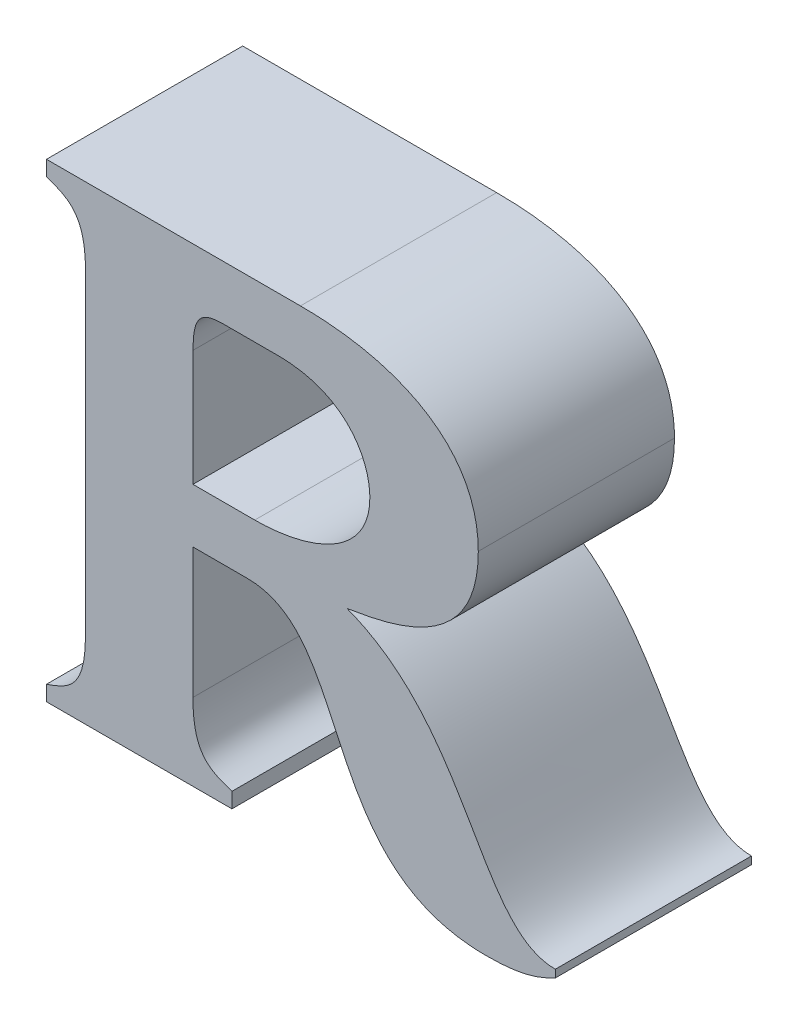
ISO-10303-21;
HEADER;
FILE_DESCRIPTION(('STEP AP214'),'2;1');
FILE_NAME('part.step','',(''),(''),'','','');
FILE_SCHEMA(('AUTOMOTIVE_DESIGN { 1 0 10303 214 1 1 1 1 }'));
ENDSEC;
DATA;
#1=APPLICATION_CONTEXT('core data for automotive mechanical design processes');
#2=APPLICATION_PROTOCOL_DEFINITION('international standard','automotive_design',2000,#1);
#3=PRODUCT_CONTEXT('',#1,'mechanical');
#4=PRODUCT('Part','Part','',(#3));
#5=PRODUCT_RELATED_PRODUCT_CATEGORY('part','',(#4));
#6=PRODUCT_DEFINITION_FORMATION('','',#4);
#7=PRODUCT_DEFINITION_CONTEXT('part definition',#1,'design');
#8=PRODUCT_DEFINITION('design','',#6,#7);
#9=PRODUCT_DEFINITION_SHAPE('','',#8);
#10=(LENGTH_UNIT() NAMED_UNIT(*) SI_UNIT(.MILLI.,.METRE.));
#11=(NAMED_UNIT(*) PLANE_ANGLE_UNIT() SI_UNIT($,.RADIAN.));
#12=(NAMED_UNIT(*) SI_UNIT($,.STERADIAN.) SOLID_ANGLE_UNIT());
#13=UNCERTAINTY_MEASURE_WITH_UNIT(LENGTH_MEASURE(1.E-05),#10,'distance_accuracy_value','');
#14=(GEOMETRIC_REPRESENTATION_CONTEXT(3) GLOBAL_UNCERTAINTY_ASSIGNED_CONTEXT((#13)) GLOBAL_UNIT_ASSIGNED_CONTEXT((#10,
#11,#12)) REPRESENTATION_CONTEXT('',''));
#15=CARTESIAN_POINT('',(0.,0.,0.));
#16=DIRECTION('',(0.,0.,1.));
#17=DIRECTION('',(1.,0.,0.));
#18=AXIS2_PLACEMENT_3D('',#15,#16,#17);
#19=CARTESIAN_POINT('',(3.0695177188296,-0.23959597746735,0.));
#20=DIRECTION('',(-1.,0.,0.));
#21=DIRECTION('',(0.,-1.,0.));
#22=AXIS2_PLACEMENT_3D('',#19,#20,#21);
#23=PLANE('',#22);
#24=DIRECTION('',(0.,-1.,0.));
#25=VECTOR('',#24,1.);
#26=CARTESIAN_POINT('',(3.0695177188296,-0.281685607356659,0.));
#27=LINE('',#26,#25);
#28=CARTESIAN_POINT('',(3.0695177188296,-0.23959597746735,0.));
#29=VERTEX_POINT('',#28);
#30=CARTESIAN_POINT('',(3.0695177188296,-0.298738196220763,0.));
#31=VERTEX_POINT('',#30);
#32=EDGE_CURVE('E11',#29,#31,#27,.T.);
#33=ORIENTED_EDGE('',*,*,#32,.F.);
#34=DIRECTION('',(0.,0.,1.));
#35=VECTOR('',#34,1.);
#36=CARTESIAN_POINT('',(3.0695177188296,-0.23959597746735,0.));
#37=LINE('',#36,#35);
#38=CARTESIAN_POINT('',(3.0695177188296,-0.23959597746735,0.1));
#39=VERTEX_POINT('',#38);
#40=EDGE_CURVE('E24',#29,#39,#37,.T.);
#41=ORIENTED_EDGE('',*,*,#40,.T.);
#42=DIRECTION('',(0.,1.,0.));
#43=VECTOR('',#42,1.);
#44=CARTESIAN_POINT('',(3.0695177188296,-0.281685607356659,0.1));
#45=LINE('',#44,#43);
#46=CARTESIAN_POINT('',(3.0695177188296,-0.298738196220763,0.1));
#47=VERTEX_POINT('',#46);
#48=EDGE_CURVE('E464',#47,#39,#45,.T.);
#49=ORIENTED_EDGE('',*,*,#48,.F.);
#50=DIRECTION('',(0.,0.,1.));
#51=VECTOR('',#50,1.);
#52=CARTESIAN_POINT('',(3.0695177188296,-0.298738196220763,0.));
#53=LINE('',#52,#51);
#54=EDGE_CURVE('E458',#31,#47,#53,.T.);
#55=ORIENTED_EDGE('',*,*,#54,.F.);
#56=EDGE_LOOP('',(#33,#41,#49,#55));
#57=FACE_BOUND('',#56,.T.);
#58=ADVANCED_FACE('F17',(#57),#23,.F.);
#59=CARTESIAN_POINT('',(3.0855156864987,-0.220205080166189,0.));
#60=CARTESIAN_POINT('',(3.0855156864987,-0.220205080166189,0.1));
#61=CARTESIAN_POINT('',(3.0733952497531,-0.220205080091428,0.));
#62=CARTESIAN_POINT('',(3.0733952497531,-0.220205080091428,0.1));
#63=CARTESIAN_POINT('',(3.0695177188059,-0.224083187468112,0.));
#64=CARTESIAN_POINT('',(3.0695177188059,-0.224083187468112,0.1));
#65=CARTESIAN_POINT('',(3.0695177188296,-0.23959597746735,0.));
#66=CARTESIAN_POINT('',(3.0695177188296,-0.23959597746735,0.1));
#67=B_SPLINE_SURFACE_WITH_KNOTS('',3,1,((#59,#60),(#61,#62),(#63,#64),(#65,#66)),.UNSPECIFIED.,
.F.,.F.,.F.,(4,4),(2,2),(-1.,0.),(0.,0.01),.UNSPECIFIED.);
#68=CARTESIAN_POINT('',(3.0855156864987,-0.220205080166189,0.));
#69=CARTESIAN_POINT('',(3.0733952497531,-0.220205080091428,0.));
#70=CARTESIAN_POINT('',(3.0695177188059,-0.224083187468112,0.));
#71=CARTESIAN_POINT('',(3.0695177188296,-0.23959597746735,0.));
#72=B_SPLINE_CURVE_WITH_KNOTS('',3,(#68,#69,#70,#71),.UNSPECIFIED.,.F.,.F.,(4,4),(-1.,0.),.UNSPECIFIED.);
#73=CARTESIAN_POINT('',(3.0855156864987,-0.220205080166189,0.));
#74=VERTEX_POINT('',#73);
#75=EDGE_CURVE('E454',#74,#29,#72,.T.);
#76=DIRECTION('',(0.,0.,1.));
#77=VECTOR('',#76,1.);
#78=CARTESIAN_POINT('',(3.0855156864987,-0.220205080166189,0.));
#79=LINE('',#78,#77);
#80=CARTESIAN_POINT('',(3.0855156864987,-0.220205080166189,0.1));
#81=VERTEX_POINT('',#80);
#82=EDGE_CURVE('E448',#74,#81,#79,.T.);
#83=CARTESIAN_POINT('',(3.0695177188296,-0.23959597746735,0.1));
#84=CARTESIAN_POINT('',(3.0695177188059,-0.224083187468112,0.1));
#85=CARTESIAN_POINT('',(3.0733952497531,-0.220205080091428,0.1));
#86=CARTESIAN_POINT('',(3.0855156864987,-0.220205080166189,0.1));
#87=B_SPLINE_CURVE_WITH_KNOTS('',3,(#83,#84,#85,#86),.UNSPECIFIED.,.F.,.F.,(4,4),(0.,1.),.UNSPECIFIED.);
#88=EDGE_CURVE('E444',#39,#81,#87,.T.);
#89=ORIENTED_EDGE('',*,*,#75,.F.);
#90=ORIENTED_EDGE('',*,*,#82,.T.);
#91=ORIENTED_EDGE('',*,*,#88,.F.);
#92=ORIENTED_EDGE('',*,*,#40,.F.);
#93=EDGE_LOOP('',(#89,#90,#91,#92));
#94=FACE_BOUND('',#93,.T.);
#95=ADVANCED_FACE('F470',(#94),#67,.F.);
#96=CARTESIAN_POINT('',(3.1126616456463,-0.220205080166189,0.));
#97=DIRECTION('',(0.,1.,0.));
#98=DIRECTION('',(-1.,0.,0.));
#99=AXIS2_PLACEMENT_3D('',#96,#97,#98);
#100=PLANE('',#99);
#101=DIRECTION('',(-1.,0.,0.));
#102=VECTOR('',#101,1.);
#103=CARTESIAN_POINT('',(3.10748859692,-0.220205080166189,0.));
#104=LINE('',#103,#102);
#105=CARTESIAN_POINT('',(3.1126616456463,-0.220205080166189,0.));
#106=VERTEX_POINT('',#105);
#107=EDGE_CURVE('E441',#106,#74,#104,.T.);
#108=ORIENTED_EDGE('',*,*,#107,.F.);
#109=DIRECTION('',(0.,0.,1.));
#110=VECTOR('',#109,1.);
#111=CARTESIAN_POINT('',(3.1126616456463,-0.220205080166189,0.));
#112=LINE('',#111,#110);
#113=CARTESIAN_POINT('',(3.1126616456463,-0.220205080166189,0.1));
#114=VERTEX_POINT('',#113);
#115=EDGE_CURVE('E439',#106,#114,#112,.T.);
#116=ORIENTED_EDGE('',*,*,#115,.T.);
#117=DIRECTION('',(1.,0.,0.));
#118=VECTOR('',#117,1.);
#119=CARTESIAN_POINT('',(3.10748859692,-0.220205080166189,0.1));
#120=LINE('',#119,#118);
#121=EDGE_CURVE('E433',#81,#114,#120,.T.);
#122=ORIENTED_EDGE('',*,*,#121,.F.);
#123=ORIENTED_EDGE('',*,*,#82,.F.);
#124=EDGE_LOOP('',(#108,#116,#122,#123));
#125=FACE_BOUND('',#124,.T.);
#126=ADVANCED_FACE('F473',(#125),#100,.F.);
#127=CARTESIAN_POINT('',(3.1596859857726,-0.259471656208063,0.));
#128=CARTESIAN_POINT('',(3.1596859857726,-0.259471656208063,0.1));
#129=CARTESIAN_POINT('',(3.1596859860106,-0.243474084868046,0.));
#130=CARTESIAN_POINT('',(3.1596859860106,-0.243474084868046,0.1));
#131=CARTESIAN_POINT('',(3.1480508714994,-0.220205079992756,0.));
#132=CARTESIAN_POINT('',(3.1480508714994,-0.220205079992756,0.1));
#133=CARTESIAN_POINT('',(3.1126616456463,-0.220205080166189,0.));
#134=CARTESIAN_POINT('',(3.1126616456463,-0.220205080166189,0.1));
#135=B_SPLINE_SURFACE_WITH_KNOTS('',3,1,((#127,#128),(#129,#130),(#131,#132),(#133,#134)),
.UNSPECIFIED.,.F.,.F.,.F.,(4,4),(2,2),(-1.,0.),(0.,0.01),.UNSPECIFIED.);
#136=CARTESIAN_POINT('',(3.1596859857726,-0.259471656208063,0.));
#137=CARTESIAN_POINT('',(3.1596859860106,-0.243474084868046,0.));
#138=CARTESIAN_POINT('',(3.1480508714994,-0.220205079992756,0.));
#139=CARTESIAN_POINT('',(3.1126616456463,-0.220205080166189,0.));
#140=B_SPLINE_CURVE_WITH_KNOTS('',3,(#136,#137,#138,#139),.UNSPECIFIED.,.F.,.F.,(4,4),(-1.,0.),.UNSPECIFIED.);
#141=CARTESIAN_POINT('',(3.1596859857726,-0.259471656208063,0.));
#142=VERTEX_POINT('',#141);
#143=EDGE_CURVE('E428',#142,#106,#140,.T.);
#144=DIRECTION('',(0.,0.,1.));
#145=VECTOR('',#144,1.);
#146=CARTESIAN_POINT('',(3.1596859857726,-0.259471656208063,0.));
#147=LINE('',#146,#145);
#148=CARTESIAN_POINT('',(3.1596859857726,-0.259471656208063,0.1));
#149=VERTEX_POINT('',#148);
#150=EDGE_CURVE('E422',#142,#149,#147,.T.);
#151=CARTESIAN_POINT('',(3.1126616456463,-0.220205080166189,0.1));
#152=CARTESIAN_POINT('',(3.1480508714994,-0.220205079992756,0.1));
#153=CARTESIAN_POINT('',(3.1596859860106,-0.243474084868046,0.1));
#154=CARTESIAN_POINT('',(3.1596859857726,-0.259471656208063,0.1));
#155=B_SPLINE_CURVE_WITH_KNOTS('',3,(#151,#152,#153,#154),.UNSPECIFIED.,.F.,.F.,(4,4),(0.,1.),.UNSPECIFIED.);
#156=EDGE_CURVE('E415',#114,#149,#155,.T.);
#157=ORIENTED_EDGE('',*,*,#143,.F.);
#158=ORIENTED_EDGE('',*,*,#150,.T.);
#159=ORIENTED_EDGE('',*,*,#156,.F.);
#160=ORIENTED_EDGE('',*,*,#115,.F.);
#161=EDGE_LOOP('',(#157,#158,#159,#160));
#162=FACE_BOUND('',#161,.T.);
#163=ADVANCED_FACE('F478',(#162),#135,.F.);
#164=CARTESIAN_POINT('',(3.101027971982,-0.298738196220763,0.));
#165=CARTESIAN_POINT('',(3.101027971982,-0.298738196220763,0.1));
#166=CARTESIAN_POINT('',(3.1286592530164,-0.29873819663257,0.));
#167=CARTESIAN_POINT('',(3.1286592530164,-0.29873819663257,0.1));
#168=CARTESIAN_POINT('',(3.159685985946,-0.287103694744521,0.));
#169=CARTESIAN_POINT('',(3.159685985946,-0.287103694744521,0.1));
#170=CARTESIAN_POINT('',(3.1596859857726,-0.259471656208063,0.));
#171=CARTESIAN_POINT('',(3.1596859857726,-0.259471656208063,0.1));
#172=B_SPLINE_SURFACE_WITH_KNOTS('',3,1,((#164,#165),(#166,#167),(#168,#169),(#170,#171)),
.UNSPECIFIED.,.F.,.F.,.F.,(4,4),(2,2),(-1.,0.),(0.,0.01),.UNSPECIFIED.);
#173=CARTESIAN_POINT('',(3.101027971982,-0.298738196220763,0.));
#174=CARTESIAN_POINT('',(3.1286592530164,-0.29873819663257,0.));
#175=CARTESIAN_POINT('',(3.159685985946,-0.287103694744521,0.));
#176=CARTESIAN_POINT('',(3.1596859857726,-0.259471656208063,0.));
#177=B_SPLINE_CURVE_WITH_KNOTS('',3,(#173,#174,#175,#176),.UNSPECIFIED.,.F.,.F.,(4,4),(-1.,0.),.UNSPECIFIED.);
#178=CARTESIAN_POINT('',(3.101027971982,-0.298738196220763,0.));
#179=VERTEX_POINT('',#178);
#180=EDGE_CURVE('E410',#179,#142,#177,.T.);
#181=DIRECTION('',(0.,0.,1.));
#182=VECTOR('',#181,1.);
#183=CARTESIAN_POINT('',(3.101027971982,-0.298738196220763,0.));
#184=LINE('',#183,#182);
#185=CARTESIAN_POINT('',(3.101027971982,-0.298738196220763,0.1));
#186=VERTEX_POINT('',#185);
#187=EDGE_CURVE('E404',#179,#186,#184,.T.);
#188=CARTESIAN_POINT('',(3.1596859857726,-0.259471656208063,0.1));
#189=CARTESIAN_POINT('',(3.159685985946,-0.287103694744521,0.1));
#190=CARTESIAN_POINT('',(3.1286592530164,-0.29873819663257,0.1));
#191=CARTESIAN_POINT('',(3.101027971982,-0.298738196220763,0.1));
#192=B_SPLINE_CURVE_WITH_KNOTS('',3,(#188,#189,#190,#191),.UNSPECIFIED.,.F.,.F.,(4,4),(0.,1.),.UNSPECIFIED.);
#193=EDGE_CURVE('E400',#149,#186,#192,.T.);
#194=ORIENTED_EDGE('',*,*,#180,.F.);
#195=ORIENTED_EDGE('',*,*,#187,.T.);
#196=ORIENTED_EDGE('',*,*,#193,.F.);
#197=ORIENTED_EDGE('',*,*,#150,.F.);
#198=EDGE_LOOP('',(#194,#195,#196,#197));
#199=FACE_BOUND('',#198,.T.);
#200=ADVANCED_FACE('F482',(#199),#172,.F.);
#201=CARTESIAN_POINT('',(3.0695177188296,-0.298738196220763,0.));
#202=DIRECTION('',(0.,-1.,0.));
#203=DIRECTION('',(1.,0.,0.));
#204=AXIS2_PLACEMENT_3D('',#201,#202,#203);
#205=PLANE('',#204);
#206=DIRECTION('',(1.,0.,0.));
#207=VECTOR('',#206,1.);
#208=CARTESIAN_POINT('',(3.0859166335116,-0.298738196220763,0.));
#209=LINE('',#208,#207);
#210=EDGE_CURVE('E398',#31,#179,#209,.T.);
#211=ORIENTED_EDGE('',*,*,#210,.F.);
#212=ORIENTED_EDGE('',*,*,#54,.T.);
#213=DIRECTION('',(-1.,0.,0.));
#214=VECTOR('',#213,1.);
#215=CARTESIAN_POINT('',(3.0859166335116,-0.298738196220763,0.1));
#216=LINE('',#215,#214);
#217=EDGE_CURVE('E392',#186,#47,#216,.T.);
#218=ORIENTED_EDGE('',*,*,#217,.F.);
#219=ORIENTED_EDGE('',*,*,#187,.F.);
#220=EDGE_LOOP('',(#211,#212,#218,#219));
#221=FACE_BOUND('',#220,.T.);
#222=ADVANCED_FACE('F485',(#221),#205,.F.);
#223=CARTESIAN_POINT('',(3.2149499890359,-0.255593368658773,0.));
#224=CARTESIAN_POINT('',(3.2149499890359,-0.255593368658773,0.1));
#225=CARTESIAN_POINT('',(3.2149499887395,-0.212448686566636,0.));
#226=CARTESIAN_POINT('',(3.2149499887395,-0.212448686566636,0.1));
#227=CARTESIAN_POINT('',(3.1756821519501,-0.192573007240326,0.));
#228=CARTESIAN_POINT('',(3.1756821519501,-0.192573007240326,0.1));
#229=CARTESIAN_POINT('',(3.1242967605046,-0.19257300647474,0.));
#230=CARTESIAN_POINT('',(3.1242967605046,-0.19257300647474,0.1));
#231=B_SPLINE_SURFACE_WITH_KNOTS('',3,1,((#223,#224),(#225,#226),(#227,#228),(#229,#230)),
.UNSPECIFIED.,.F.,.F.,.F.,(4,4),(2,2),(-1.,0.),(0.,0.01),.UNSPECIFIED.);
#232=CARTESIAN_POINT('',(3.1242967605046,-0.19257300647474,0.));
#233=CARTESIAN_POINT('',(3.1756821519501,-0.192573007240326,0.));
#234=CARTESIAN_POINT('',(3.2149499887395,-0.212448686566636,0.));
#235=CARTESIAN_POINT('',(3.2149499890359,-0.255593368658773,0.));
#236=B_SPLINE_CURVE_WITH_KNOTS('',3,(#232,#233,#234,#235),.UNSPECIFIED.,.F.,.F.,(4,4),(0.,1.),.UNSPECIFIED.);
#237=CARTESIAN_POINT('',(3.1242967605046,-0.19257300647474,0.));
#238=VERTEX_POINT('',#237);
#239=CARTESIAN_POINT('',(3.2149499890359,-0.255593368658773,0.));
#240=VERTEX_POINT('',#239);
#241=EDGE_CURVE('E388',#238,#240,#236,.T.);
#242=DIRECTION('',(0.,0.,1.));
#243=VECTOR('',#242,1.);
#244=CARTESIAN_POINT('',(3.1242967605046,-0.19257300647474,0.));
#245=LINE('',#244,#243);
#246=CARTESIAN_POINT('',(3.1242967605046,-0.19257300647474,0.1));
#247=VERTEX_POINT('',#246);
#248=EDGE_CURVE('E383',#238,#247,#245,.T.);
#249=CARTESIAN_POINT('',(3.2149499890359,-0.255593368658773,0.1));
#250=CARTESIAN_POINT('',(3.2149499887395,-0.212448686566636,0.1));
#251=CARTESIAN_POINT('',(3.1756821519501,-0.192573007240326,0.1));
#252=CARTESIAN_POINT('',(3.1242967605046,-0.19257300647474,0.1));
#253=B_SPLINE_CURVE_WITH_KNOTS('',3,(#249,#250,#251,#252),.UNSPECIFIED.,.F.,.F.,(4,4),(-1.,0.),.UNSPECIFIED.);
#254=CARTESIAN_POINT('',(3.2149499890359,-0.255593368658773,0.1));
#255=VERTEX_POINT('',#254);
#256=EDGE_CURVE('E194',#255,#247,#253,.T.);
#257=DIRECTION('',(0.,0.,1.));
#258=VECTOR('',#257,1.);
#259=CARTESIAN_POINT('',(3.2149499890359,-0.255593368658773,0.));
#260=LINE('',#259,#258);
#261=EDGE_CURVE('E374',#240,#255,#260,.T.);
#262=ORIENTED_EDGE('',*,*,#241,.F.);
#263=ORIENTED_EDGE('',*,*,#248,.T.);
#264=ORIENTED_EDGE('',*,*,#256,.F.);
#265=ORIENTED_EDGE('',*,*,#261,.F.);
#266=EDGE_LOOP('',(#262,#263,#264,#265));
#267=FACE_BOUND('',#266,.T.);
#268=ADVANCED_FACE('F533',(#267),#231,.T.);
#269=CARTESIAN_POINT('',(3.1480508709143,-0.314250986121448,0.));
#270=CARTESIAN_POINT('',(3.1480508709143,-0.314250986121448,0.1));
#271=CARTESIAN_POINT('',(3.1718046202094,-0.31037273395839,0.));
#272=CARTESIAN_POINT('',(3.1718046202094,-0.31037273395839,0.1));
#273=CARTESIAN_POINT('',(3.2149499883353,-0.302616339651443,0.));
#274=CARTESIAN_POINT('',(3.2149499883353,-0.302616339651443,0.1));
#275=CARTESIAN_POINT('',(3.2149499890359,-0.255593368658773,0.));
#276=CARTESIAN_POINT('',(3.2149499890359,-0.255593368658773,0.1));
#277=B_SPLINE_SURFACE_WITH_KNOTS('',3,1,((#269,#270),(#271,#272),(#273,#274),(#275,#276)),
.UNSPECIFIED.,.F.,.F.,.F.,(4,4),(2,2),(-1.,0.),(0.,0.01),.UNSPECIFIED.);
#278=CARTESIAN_POINT('',(3.2149499890359,-0.255593368658773,0.));
#279=CARTESIAN_POINT('',(3.2149499883353,-0.302616339651443,0.));
#280=CARTESIAN_POINT('',(3.1718046202094,-0.31037273395839,0.));
#281=CARTESIAN_POINT('',(3.1480508709143,-0.314250986121448,0.));
#282=B_SPLINE_CURVE_WITH_KNOTS('',3,(#278,#279,#280,#281),.UNSPECIFIED.,.F.,.F.,(4,4),(0.,1.),.UNSPECIFIED.);
#283=CARTESIAN_POINT('',(3.1480508709143,-0.314250986121448,0.));
#284=VERTEX_POINT('',#283);
#285=EDGE_CURVE('E367',#240,#284,#282,.T.);
#286=CARTESIAN_POINT('',(3.1480508709143,-0.314250986121448,0.1));
#287=CARTESIAN_POINT('',(3.1718046202094,-0.31037273395839,0.1));
#288=CARTESIAN_POINT('',(3.2149499883353,-0.302616339651443,0.1));
#289=CARTESIAN_POINT('',(3.2149499890359,-0.255593368658773,0.1));
#290=B_SPLINE_CURVE_WITH_KNOTS('',3,(#286,#287,#288,#289),.UNSPECIFIED.,.F.,.F.,(4,4),(-1.,0.),.UNSPECIFIED.);
#291=CARTESIAN_POINT('',(3.1480508709143,-0.314250986121448,0.1));
#292=VERTEX_POINT('',#291);
#293=EDGE_CURVE('E363',#292,#255,#290,.T.);
#294=DIRECTION('',(0.,0.,1.));
#295=VECTOR('',#294,1.);
#296=CARTESIAN_POINT('',(3.1480508709143,-0.314250986121448,0.));
#297=LINE('',#296,#295);
#298=EDGE_CURVE('E357',#284,#292,#297,.T.);
#299=ORIENTED_EDGE('',*,*,#285,.F.);
#300=ORIENTED_EDGE('',*,*,#261,.T.);
#301=ORIENTED_EDGE('',*,*,#293,.F.);
#302=ORIENTED_EDGE('',*,*,#298,.F.);
#303=EDGE_LOOP('',(#299,#300,#301,#302));
#304=FACE_BOUND('',#303,.T.);
#305=ADVANCED_FACE('F538',(#304),#277,.T.);
#306=CARTESIAN_POINT('',(3.2542163849288,-0.420416067777929,0.));
#307=CARTESIAN_POINT('',(3.2542163849288,-0.420416067777929,0.1));
#308=CARTESIAN_POINT('',(3.214949987454,-0.420416068774822,0.));
#309=CARTESIAN_POINT('',(3.214949987454,-0.420416068774822,0.1));
#310=CARTESIAN_POINT('',(3.2110710165652,-0.338004773202779,0.));
#311=CARTESIAN_POINT('',(3.2110710165652,-0.338004773202779,0.1));
#312=CARTESIAN_POINT('',(3.1480508709143,-0.314250986121448,0.));
#313=CARTESIAN_POINT('',(3.1480508709143,-0.314250986121448,0.1));
#314=B_SPLINE_SURFACE_WITH_KNOTS('',3,1,((#306,#307),(#308,#309),(#310,#311),(#312,#313)),
.UNSPECIFIED.,.F.,.F.,.F.,(4,4),(2,2),(-1.,0.),(0.,0.01),.UNSPECIFIED.);
#315=CARTESIAN_POINT('',(3.1480508709143,-0.314250986121448,0.));
#316=CARTESIAN_POINT('',(3.2110710165652,-0.338004773202779,0.));
#317=CARTESIAN_POINT('',(3.214949987454,-0.420416068774822,0.));
#318=CARTESIAN_POINT('',(3.2542163849288,-0.420416067777929,0.));
#319=B_SPLINE_CURVE_WITH_KNOTS('',3,(#315,#316,#317,#318),.UNSPECIFIED.,.F.,.F.,(4,4),(0.,1.),.UNSPECIFIED.);
#320=CARTESIAN_POINT('',(3.2542163849288,-0.420416067777929,0.));
#321=VERTEX_POINT('',#320);
#322=EDGE_CURVE('E350',#284,#321,#319,.T.);
#323=CARTESIAN_POINT('',(3.2542163849288,-0.420416067777929,0.1));
#324=CARTESIAN_POINT('',(3.214949987454,-0.420416068774822,0.1));
#325=CARTESIAN_POINT('',(3.2110710165652,-0.338004773202779,0.1));
#326=CARTESIAN_POINT('',(3.1480508709143,-0.314250986121448,0.1));
#327=B_SPLINE_CURVE_WITH_KNOTS('',3,(#323,#324,#325,#326),.UNSPECIFIED.,.F.,.F.,(4,4),(-1.,0.),.UNSPECIFIED.);
#328=CARTESIAN_POINT('',(3.2542163849288,-0.420416067777929,0.1));
#329=VERTEX_POINT('',#328);
#330=EDGE_CURVE('E345',#329,#292,#327,.T.);
#331=DIRECTION('',(0.,0.,1.));
#332=VECTOR('',#331,1.);
#333=CARTESIAN_POINT('',(3.2542163849288,-0.420416067777929,0.));
#334=LINE('',#333,#332);
#335=EDGE_CURVE('E342',#321,#329,#334,.T.);
#336=ORIENTED_EDGE('',*,*,#322,.F.);
#337=ORIENTED_EDGE('',*,*,#298,.T.);
#338=ORIENTED_EDGE('',*,*,#330,.F.);
#339=ORIENTED_EDGE('',*,*,#335,.F.);
#340=EDGE_LOOP('',(#336,#337,#338,#339));
#341=FACE_BOUND('',#340,.T.);
#342=ADVANCED_FACE('F549',(#341),#314,.T.);
#343=CARTESIAN_POINT('',(3.2542163849288,-0.424294319298148,0.));
#344=DIRECTION('',(1.,0.,0.));
#345=DIRECTION('',(0.,1.,0.));
#346=AXIS2_PLACEMENT_3D('',#343,#344,#345);
#347=PLANE('',#346);
#348=DIRECTION('',(0.,-1.,0.));
#349=VECTOR('',#348,1.);
#350=CARTESIAN_POINT('',(3.2542163849288,-0.420416067777929,0.));
#351=LINE('',#350,#349);
#352=CARTESIAN_POINT('',(3.2542163849288,-0.424294319298148,0.));
#353=VERTEX_POINT('',#352);
#354=EDGE_CURVE('E340',#321,#353,#351,.T.);
#355=ORIENTED_EDGE('',*,*,#354,.F.);
#356=ORIENTED_EDGE('',*,*,#335,.T.);
#357=DIRECTION('',(0.,1.,0.));
#358=VECTOR('',#357,1.);
#359=CARTESIAN_POINT('',(3.2542163849288,-0.420416067777929,0.1));
#360=LINE('',#359,#358);
#361=CARTESIAN_POINT('',(3.2542163849288,-0.424294319298148,0.1));
#362=VERTEX_POINT('',#361);
#363=EDGE_CURVE('E337',#362,#329,#360,.T.);
#364=ORIENTED_EDGE('',*,*,#363,.F.);
#365=DIRECTION('',(0.,0.,1.));
#366=VECTOR('',#365,1.);
#367=CARTESIAN_POINT('',(3.2542163849288,-0.424294319298148,0.));
#368=LINE('',#367,#366);
#369=EDGE_CURVE('E331',#353,#362,#368,.T.);
#370=ORIENTED_EDGE('',*,*,#369,.F.);
#371=EDGE_LOOP('',(#355,#356,#364,#370));
#372=FACE_BOUND('',#371,.T.);
#373=ADVANCED_FACE('F560',(#372),#347,.T.);
#374=CARTESIAN_POINT('',(3.2188275199597,-0.432050714249068,0.));
#375=CARTESIAN_POINT('',(3.2188275199597,-0.432050714249068,0.1));
#376=CARTESIAN_POINT('',(3.2387026584163,-0.432050714575945,0.));
#377=CARTESIAN_POINT('',(3.2387026584163,-0.432050714575945,0.1));
#378=CARTESIAN_POINT('',(3.2464602422703,-0.428172426861984,0.));
#379=CARTESIAN_POINT('',(3.2464602422703,-0.428172426861984,0.1));
#380=CARTESIAN_POINT('',(3.2542163849288,-0.424294319298148,0.));
#381=CARTESIAN_POINT('',(3.2542163849288,-0.424294319298148,0.1));
#382=B_SPLINE_SURFACE_WITH_KNOTS('',3,1,((#374,#375),(#376,#377),(#378,#379),(#380,#381)),
.UNSPECIFIED.,.F.,.F.,.F.,(4,4),(2,2),(-1.,0.),(0.,0.01),.UNSPECIFIED.);
#383=CARTESIAN_POINT('',(3.2542163849288,-0.424294319298148,0.));
#384=CARTESIAN_POINT('',(3.2464602422703,-0.428172426861984,0.));
#385=CARTESIAN_POINT('',(3.2387026584163,-0.432050714575945,0.));
#386=CARTESIAN_POINT('',(3.2188275199597,-0.432050714249068,0.));
#387=B_SPLINE_CURVE_WITH_KNOTS('',3,(#383,#384,#385,#386),.UNSPECIFIED.,.F.,.F.,(4,4),(0.,1.),.UNSPECIFIED.);
#388=CARTESIAN_POINT('',(3.2188275199597,-0.432050714249068,0.));
#389=VERTEX_POINT('',#388);
#390=EDGE_CURVE('E324',#353,#389,#387,.T.);
#391=CARTESIAN_POINT('',(3.2188275199597,-0.432050714249068,0.1));
#392=CARTESIAN_POINT('',(3.2387026584163,-0.432050714575945,0.1));
#393=CARTESIAN_POINT('',(3.2464602422703,-0.428172426861984,0.1));
#394=CARTESIAN_POINT('',(3.2542163849288,-0.424294319298148,0.1));
#395=B_SPLINE_CURVE_WITH_KNOTS('',3,(#391,#392,#393,#394),.UNSPECIFIED.,.F.,.F.,(4,4),(-1.,0.),.UNSPECIFIED.);
#396=CARTESIAN_POINT('',(3.2188275199597,-0.432050714249068,0.1));
#397=VERTEX_POINT('',#396);
#398=EDGE_CURVE('E319',#397,#362,#395,.T.);
#399=DIRECTION('',(0.,0.,1.));
#400=VECTOR('',#399,1.);
#401=CARTESIAN_POINT('',(3.2188275199597,-0.432050714249068,0.));
#402=LINE('',#401,#400);
#403=EDGE_CURVE('E313',#389,#397,#402,.T.);
#404=ORIENTED_EDGE('',*,*,#390,.F.);
#405=ORIENTED_EDGE('',*,*,#369,.T.);
#406=ORIENTED_EDGE('',*,*,#398,.F.);
#407=ORIENTED_EDGE('',*,*,#403,.F.);
#408=EDGE_LOOP('',(#404,#405,#406,#407));
#409=FACE_BOUND('',#408,.T.);
#410=ADVANCED_FACE('F569',(#409),#382,.T.);
#411=CARTESIAN_POINT('',(3.097149360163,-0.326370269912293,0.));
#412=CARTESIAN_POINT('',(3.097149360163,-0.326370269912293,0.1));
#413=CARTESIAN_POINT('',(3.1519280431139,-0.3263702689155,0.));
#414=CARTESIAN_POINT('',(3.1519280431139,-0.3263702689155,0.1));
#415=CARTESIAN_POINT('',(3.1325382251336,-0.432050712963309,0.));
#416=CARTESIAN_POINT('',(3.1325382251336,-0.432050712963309,0.1));
#417=CARTESIAN_POINT('',(3.2188275199597,-0.432050714249068,0.));
#418=CARTESIAN_POINT('',(3.2188275199597,-0.432050714249068,0.1));
#419=B_SPLINE_SURFACE_WITH_KNOTS('',3,1,((#411,#412),(#413,#414),(#415,#416),(#417,#418)),
.UNSPECIFIED.,.F.,.F.,.F.,(4,4),(2,2),(-1.,0.),(0.,0.01),.UNSPECIFIED.);
#420=CARTESIAN_POINT('',(3.2188275199597,-0.432050714249068,0.));
#421=CARTESIAN_POINT('',(3.1325382251336,-0.432050712963309,0.));
#422=CARTESIAN_POINT('',(3.1519280431139,-0.3263702689155,0.));
#423=CARTESIAN_POINT('',(3.097149360163,-0.326370269912293,0.));
#424=B_SPLINE_CURVE_WITH_KNOTS('',3,(#420,#421,#422,#423),.UNSPECIFIED.,.F.,.F.,(4,4),(0.,1.),.UNSPECIFIED.);
#425=CARTESIAN_POINT('',(3.097149360163,-0.326370269912293,0.));
#426=VERTEX_POINT('',#425);
#427=EDGE_CURVE('E306',#389,#426,#424,.T.);
#428=CARTESIAN_POINT('',(3.097149360163,-0.326370269912293,0.1));
#429=CARTESIAN_POINT('',(3.1519280431139,-0.3263702689155,0.1));
#430=CARTESIAN_POINT('',(3.1325382251336,-0.432050712963309,0.1));
#431=CARTESIAN_POINT('',(3.2188275199597,-0.432050714249068,0.1));
#432=B_SPLINE_CURVE_WITH_KNOTS('',3,(#428,#429,#430,#431),.UNSPECIFIED.,.F.,.F.,(4,4),(-1.,0.),.UNSPECIFIED.);
#433=CARTESIAN_POINT('',(3.097149360163,-0.326370269912293,0.1));
#434=VERTEX_POINT('',#433);
#435=EDGE_CURVE('E301',#434,#397,#432,.T.);
#436=DIRECTION('',(0.,0.,1.));
#437=VECTOR('',#436,1.);
#438=CARTESIAN_POINT('',(3.097149360163,-0.326370269912293,0.));
#439=LINE('',#438,#437);
#440=EDGE_CURVE('E298',#426,#434,#439,.T.);
#441=ORIENTED_EDGE('',*,*,#427,.F.);
#442=ORIENTED_EDGE('',*,*,#403,.T.);
#443=ORIENTED_EDGE('',*,*,#435,.F.);
#444=ORIENTED_EDGE('',*,*,#440,.F.);
#445=EDGE_LOOP('',(#441,#442,#443,#444));
#446=FACE_BOUND('',#445,.T.);
#447=ADVANCED_FACE('F575',(#446),#419,.T.);
#448=CARTESIAN_POINT('',(3.0695177188296,-0.326370269912293,0.));
#449=DIRECTION('',(0.,-1.,0.));
#450=DIRECTION('',(1.,0.,0.));
#451=AXIS2_PLACEMENT_3D('',#448,#449,#450);
#452=PLANE('',#451);
#453=DIRECTION('',(-1.,0.,0.));
#454=VECTOR('',#453,1.);
#455=CARTESIAN_POINT('',(3.097149360163,-0.326370269912293,0.));
#456=LINE('',#455,#454);
#457=CARTESIAN_POINT('',(3.0695177188296,-0.326370269912293,0.));
#458=VERTEX_POINT('',#457);
#459=EDGE_CURVE('E296',#426,#458,#456,.T.);
#460=ORIENTED_EDGE('',*,*,#459,.F.);
#461=ORIENTED_EDGE('',*,*,#440,.T.);
#462=DIRECTION('',(1.,0.,0.));
#463=VECTOR('',#462,1.);
#464=CARTESIAN_POINT('',(3.097149360163,-0.326370269912293,0.1));
#465=LINE('',#464,#463);
#466=CARTESIAN_POINT('',(3.0695177188296,-0.326370269912293,0.1));
#467=VERTEX_POINT('',#466);
#468=EDGE_CURVE('E293',#467,#434,#465,.T.);
#469=ORIENTED_EDGE('',*,*,#468,.F.);
#470=DIRECTION('',(0.,0.,1.));
#471=VECTOR('',#470,1.);
#472=CARTESIAN_POINT('',(3.0695177188296,-0.326370269912293,0.));
#473=LINE('',#472,#471);
#474=EDGE_CURVE('E290',#458,#467,#473,.T.);
#475=ORIENTED_EDGE('',*,*,#474,.F.);
#476=EDGE_LOOP('',(#460,#461,#469,#475));
#477=FACE_BOUND('',#476,.T.);
#478=ADVANCED_FACE('F586',(#477),#452,.T.);
#479=CARTESIAN_POINT('',(3.0695177188296,-0.392784138206144,0.));
#480=DIRECTION('',(1.,0.,0.));
#481=DIRECTION('',(0.,1.,0.));
#482=AXIS2_PLACEMENT_3D('',#479,#480,#481);
#483=PLANE('',#482);
#484=DIRECTION('',(0.,-1.,0.));
#485=VECTOR('',#484,1.);
#486=CARTESIAN_POINT('',(3.0695177188296,-0.326370269912293,0.));
#487=LINE('',#486,#485);
#488=CARTESIAN_POINT('',(3.0695177188296,-0.392784138206144,0.));
#489=VERTEX_POINT('',#488);
#490=EDGE_CURVE('E288',#458,#489,#487,.T.);
#491=ORIENTED_EDGE('',*,*,#490,.F.);
#492=ORIENTED_EDGE('',*,*,#474,.T.);
#493=DIRECTION('',(0.,1.,0.));
#494=VECTOR('',#493,1.);
#495=CARTESIAN_POINT('',(3.0695177188296,-0.326370269912293,0.1));
#496=LINE('',#495,#494);
#497=CARTESIAN_POINT('',(3.0695177188296,-0.392784138206144,0.1));
#498=VERTEX_POINT('',#497);
#499=EDGE_CURVE('E285',#498,#467,#496,.T.);
#500=ORIENTED_EDGE('',*,*,#499,.F.);
#501=DIRECTION('',(0.,0.,1.));
#502=VECTOR('',#501,1.);
#503=CARTESIAN_POINT('',(3.0695177188296,-0.392784138206144,0.));
#504=LINE('',#503,#502);
#505=EDGE_CURVE('E279',#489,#498,#504,.T.);
#506=ORIENTED_EDGE('',*,*,#505,.F.);
#507=EDGE_LOOP('',(#491,#492,#500,#506));
#508=FACE_BOUND('',#507,.T.);
#509=ADVANCED_FACE('F595',(#508),#483,.T.);
#510=CARTESIAN_POINT('',(3.0893928571237,-0.424294319298148,0.));
#511=CARTESIAN_POINT('',(3.0893928571237,-0.424294319298148,0.1));
#512=CARTESIAN_POINT('',(3.0772742218703,-0.420416067777872,0.));
#513=CARTESIAN_POINT('',(3.0772742218703,-0.420416067777872,0.1));
#514=CARTESIAN_POINT('',(3.0695177188292,-0.416537924348321,0.));
#515=CARTESIAN_POINT('',(3.0695177188292,-0.416537924348321,0.1));
#516=CARTESIAN_POINT('',(3.0695177188296,-0.392784138206144,0.));
#517=CARTESIAN_POINT('',(3.0695177188296,-0.392784138206144,0.1));
#518=B_SPLINE_SURFACE_WITH_KNOTS('',3,1,((#510,#511),(#512,#513),(#514,#515),(#516,#517)),
.UNSPECIFIED.,.F.,.F.,.F.,(4,4),(2,2),(-1.,0.),(0.,0.01),.UNSPECIFIED.);
#519=CARTESIAN_POINT('',(3.0695177188296,-0.392784138206144,0.));
#520=CARTESIAN_POINT('',(3.0695177188292,-0.416537924348321,0.));
#521=CARTESIAN_POINT('',(3.0772742218703,-0.420416067777872,0.));
#522=CARTESIAN_POINT('',(3.0893928571237,-0.424294319298148,0.));
#523=B_SPLINE_CURVE_WITH_KNOTS('',3,(#519,#520,#521,#522),.UNSPECIFIED.,.F.,.F.,(4,4),(0.,1.),.UNSPECIFIED.);
#524=CARTESIAN_POINT('',(3.0893928571237,-0.424294319298148,0.));
#525=VERTEX_POINT('',#524);
#526=EDGE_CURVE('E272',#489,#525,#523,.T.);
#527=CARTESIAN_POINT('',(3.0893928571237,-0.424294319298148,0.1));
#528=CARTESIAN_POINT('',(3.0772742218703,-0.420416067777872,0.1));
#529=CARTESIAN_POINT('',(3.0695177188292,-0.416537924348321,0.1));
#530=CARTESIAN_POINT('',(3.0695177188296,-0.392784138206144,0.1));
#531=B_SPLINE_CURVE_WITH_KNOTS('',3,(#527,#528,#529,#530),.UNSPECIFIED.,.F.,.F.,(4,4),(-1.,0.),.UNSPECIFIED.);
#532=CARTESIAN_POINT('',(3.0893928571237,-0.424294319298148,0.1));
#533=VERTEX_POINT('',#532);
#534=EDGE_CURVE('E267',#533,#498,#531,.T.);
#535=DIRECTION('',(0.,0.,1.));
#536=VECTOR('',#535,1.);
#537=CARTESIAN_POINT('',(3.0893928571237,-0.424294319298148,0.));
#538=LINE('',#537,#536);
#539=EDGE_CURVE('E264',#525,#533,#538,.T.);
#540=ORIENTED_EDGE('',*,*,#526,.F.);
#541=ORIENTED_EDGE('',*,*,#505,.T.);
#542=ORIENTED_EDGE('',*,*,#534,.F.);
#543=ORIENTED_EDGE('',*,*,#539,.F.);
#544=EDGE_LOOP('',(#540,#541,#542,#543));
#545=FACE_BOUND('',#544,.T.);
#546=ADVANCED_FACE('F599',(#545),#518,.T.);
#547=CARTESIAN_POINT('',(3.0893928571237,-0.432050714249068,0.));
#548=DIRECTION('',(1.,0.,0.));
#549=DIRECTION('',(0.,1.,0.));
#550=AXIS2_PLACEMENT_3D('',#547,#548,#549);
#551=PLANE('',#550);
#552=DIRECTION('',(0.,-1.,0.));
#553=VECTOR('',#552,1.);
#554=CARTESIAN_POINT('',(3.0893928571237,-0.424294319298148,0.));
#555=LINE('',#554,#553);
#556=CARTESIAN_POINT('',(3.0893928571237,-0.432050714249068,0.));
#557=VERTEX_POINT('',#556);
#558=EDGE_CURVE('E262',#525,#557,#555,.T.);
#559=ORIENTED_EDGE('',*,*,#558,.F.);
#560=ORIENTED_EDGE('',*,*,#539,.T.);
#561=DIRECTION('',(0.,1.,0.));
#562=VECTOR('',#561,1.);
#563=CARTESIAN_POINT('',(3.0893928571237,-0.424294319298148,0.1));
#564=LINE('',#563,#562);
#565=CARTESIAN_POINT('',(3.0893928571237,-0.432050714249068,0.1));
#566=VERTEX_POINT('',#565);
#567=EDGE_CURVE('E259',#566,#533,#564,.T.);
#568=ORIENTED_EDGE('',*,*,#567,.F.);
#569=DIRECTION('',(0.,0.,1.));
#570=VECTOR('',#569,1.);
#571=CARTESIAN_POINT('',(3.0893928571237,-0.432050714249068,0.));
#572=LINE('',#571,#570);
#573=EDGE_CURVE('E256',#557,#566,#572,.T.);
#574=ORIENTED_EDGE('',*,*,#573,.F.);
#575=EDGE_LOOP('',(#559,#560,#568,#574));
#576=FACE_BOUND('',#575,.T.);
#577=ADVANCED_FACE('F605',(#576),#551,.T.);
#578=CARTESIAN_POINT('',(2.9948624579663,-0.432050714249068,0.));
#579=DIRECTION('',(0.,-1.,0.));
#580=DIRECTION('',(1.,0.,0.));
#581=AXIS2_PLACEMENT_3D('',#578,#579,#580);
#582=PLANE('',#581);
#583=DIRECTION('',(-1.,0.,0.));
#584=VECTOR('',#583,1.);
#585=CARTESIAN_POINT('',(3.0893928571237,-0.432050714249068,0.));
#586=LINE('',#585,#584);
#587=CARTESIAN_POINT('',(2.9948624579663,-0.432050714249068,0.));
#588=VERTEX_POINT('',#587);
#589=EDGE_CURVE('E254',#557,#588,#586,.T.);
#590=ORIENTED_EDGE('',*,*,#589,.F.);
#591=ORIENTED_EDGE('',*,*,#573,.T.);
#592=DIRECTION('',(1.,0.,0.));
#593=VECTOR('',#592,1.);
#594=CARTESIAN_POINT('',(3.0893928571237,-0.432050714249068,0.1));
#595=LINE('',#594,#593);
#596=CARTESIAN_POINT('',(2.9948624579663,-0.432050714249068,0.1));
#597=VERTEX_POINT('',#596);
#598=EDGE_CURVE('E251',#597,#566,#595,.T.);
#599=ORIENTED_EDGE('',*,*,#598,.F.);
#600=DIRECTION('',(0.,0.,1.));
#601=VECTOR('',#600,1.);
#602=CARTESIAN_POINT('',(2.9948624579663,-0.432050714249068,0.));
#603=LINE('',#602,#601);
#604=EDGE_CURVE('E248',#588,#597,#603,.T.);
#605=ORIENTED_EDGE('',*,*,#604,.F.);
#606=EDGE_LOOP('',(#590,#591,#599,#605));
#607=FACE_BOUND('',#606,.T.);
#608=ADVANCED_FACE('F614',(#607),#582,.T.);
#609=CARTESIAN_POINT('',(2.9948624579663,-0.424294319298148,0.));
#610=DIRECTION('',(-1.,0.,0.));
#611=DIRECTION('',(0.,-1.,0.));
#612=AXIS2_PLACEMENT_3D('',#609,#610,#611);
#613=PLANE('',#612);
#614=DIRECTION('',(0.,1.,0.));
#615=VECTOR('',#614,1.);
#616=CARTESIAN_POINT('',(2.9948624579663,-0.432050714249068,0.));
#617=LINE('',#616,#615);
#618=CARTESIAN_POINT('',(2.9948624579663,-0.424294319298148,0.));
#619=VERTEX_POINT('',#618);
#620=EDGE_CURVE('E246',#588,#619,#617,.T.);
#621=ORIENTED_EDGE('',*,*,#620,.F.);
#622=ORIENTED_EDGE('',*,*,#604,.T.);
#623=DIRECTION('',(0.,-1.,0.));
#624=VECTOR('',#623,1.);
#625=CARTESIAN_POINT('',(2.9948624579663,-0.432050714249068,0.1));
#626=LINE('',#625,#624);
#627=CARTESIAN_POINT('',(2.9948624579663,-0.424294319298148,0.1));
#628=VERTEX_POINT('',#627);
#629=EDGE_CURVE('E243',#628,#597,#626,.T.);
#630=ORIENTED_EDGE('',*,*,#629,.F.);
#631=DIRECTION('',(0.,0.,1.));
#632=VECTOR('',#631,1.);
#633=CARTESIAN_POINT('',(2.9948624579663,-0.424294319298148,0.));
#634=LINE('',#633,#632);
#635=EDGE_CURVE('E237',#619,#628,#634,.T.);
#636=ORIENTED_EDGE('',*,*,#635,.F.);
#637=EDGE_LOOP('',(#621,#622,#630,#636));
#638=FACE_BOUND('',#637,.T.);
#639=ADVANCED_FACE('F618',(#638),#613,.T.);
#640=CARTESIAN_POINT('',(3.0147375962605,-0.392784138206144,0.));
#641=CARTESIAN_POINT('',(3.0147375962605,-0.392784138206144,0.1));
#642=CARTESIAN_POINT('',(3.014737596097,-0.416537923929484,0.));
#643=CARTESIAN_POINT('',(3.014737596097,-0.416537923929484,0.1));
#644=CARTESIAN_POINT('',(3.0064975727429,-0.420416067532681,0.));
#645=CARTESIAN_POINT('',(3.0064975727429,-0.420416067532681,0.1));
#646=CARTESIAN_POINT('',(2.9948624579663,-0.424294319298148,0.));
#647=CARTESIAN_POINT('',(2.9948624579663,-0.424294319298148,0.1));
#648=B_SPLINE_SURFACE_WITH_KNOTS('',3,1,((#640,#641),(#642,#643),(#644,#645),(#646,#647)),
.UNSPECIFIED.,.F.,.F.,.F.,(4,4),(2,2),(-1.,0.),(0.,0.01),.UNSPECIFIED.);
#649=CARTESIAN_POINT('',(2.9948624579663,-0.424294319298148,0.));
#650=CARTESIAN_POINT('',(3.0064975727429,-0.420416067532681,0.));
#651=CARTESIAN_POINT('',(3.014737596097,-0.416537923929484,0.));
#652=CARTESIAN_POINT('',(3.0147375962605,-0.392784138206144,0.));
#653=B_SPLINE_CURVE_WITH_KNOTS('',3,(#649,#650,#651,#652),.UNSPECIFIED.,.F.,.F.,(4,4),(0.,1.),.UNSPECIFIED.);
#654=CARTESIAN_POINT('',(3.0147375962605,-0.392784138206144,0.));
#655=VERTEX_POINT('',#654);
#656=EDGE_CURVE('E230',#619,#655,#653,.T.);
#657=CARTESIAN_POINT('',(3.0147375962605,-0.392784138206144,0.1));
#658=CARTESIAN_POINT('',(3.014737596097,-0.416537923929484,0.1));
#659=CARTESIAN_POINT('',(3.0064975727429,-0.420416067532681,0.1));
#660=CARTESIAN_POINT('',(2.9948624579663,-0.424294319298148,0.1));
#661=B_SPLINE_CURVE_WITH_KNOTS('',3,(#657,#658,#659,#660),.UNSPECIFIED.,.F.,.F.,(4,4),(-1.,0.),.UNSPECIFIED.);
#662=CARTESIAN_POINT('',(3.0147375962605,-0.392784138206144,0.1));
#663=VERTEX_POINT('',#662);
#664=EDGE_CURVE('E225',#663,#628,#661,.T.);
#665=DIRECTION('',(0.,0.,1.));
#666=VECTOR('',#665,1.);
#667=CARTESIAN_POINT('',(3.0147375962605,-0.392784138206144,0.));
#668=LINE('',#667,#666);
#669=EDGE_CURVE('E222',#655,#663,#668,.T.);
#670=ORIENTED_EDGE('',*,*,#656,.F.);
#671=ORIENTED_EDGE('',*,*,#635,.T.);
#672=ORIENTED_EDGE('',*,*,#664,.F.);
#673=ORIENTED_EDGE('',*,*,#669,.F.);
#674=EDGE_LOOP('',(#670,#671,#672,#673));
#675=FACE_BOUND('',#674,.T.);
#676=ADVANCED_FACE('F622',(#675),#648,.T.);
#677=CARTESIAN_POINT('',(3.0147375962605,-0.231839582517053,0.));
#678=DIRECTION('',(-1.,0.,0.));
#679=DIRECTION('',(0.,-1.,0.));
#680=AXIS2_PLACEMENT_3D('',#677,#678,#679);
#681=PLANE('',#680);
#682=DIRECTION('',(0.,1.,0.));
#683=VECTOR('',#682,1.);
#684=CARTESIAN_POINT('',(3.0147375962605,-0.392784138206144,0.));
#685=LINE('',#684,#683);
#686=CARTESIAN_POINT('',(3.0147375962605,-0.231839582517053,0.));
#687=VERTEX_POINT('',#686);
#688=EDGE_CURVE('E220',#655,#687,#685,.T.);
#689=ORIENTED_EDGE('',*,*,#688,.F.);
#690=ORIENTED_EDGE('',*,*,#669,.T.);
#691=DIRECTION('',(0.,-1.,0.));
#692=VECTOR('',#691,1.);
#693=CARTESIAN_POINT('',(3.0147375962605,-0.392784138206144,0.1));
#694=LINE('',#693,#692);
#695=CARTESIAN_POINT('',(3.0147375962605,-0.231839582517053,0.1));
#696=VERTEX_POINT('',#695);
#697=EDGE_CURVE('E217',#696,#663,#694,.T.);
#698=ORIENTED_EDGE('',*,*,#697,.F.);
#699=DIRECTION('',(0.,0.,1.));
#700=VECTOR('',#699,1.);
#701=CARTESIAN_POINT('',(3.0147375962605,-0.231839582517053,0.));
#702=LINE('',#701,#700);
#703=EDGE_CURVE('E211',#687,#696,#702,.T.);
#704=ORIENTED_EDGE('',*,*,#703,.F.);
#705=EDGE_LOOP('',(#689,#690,#698,#704));
#706=FACE_BOUND('',#705,.T.);
#707=ADVANCED_FACE('F628',(#706),#681,.T.);
#708=CARTESIAN_POINT('',(2.9948624579663,-0.200329401425036,0.));
#709=CARTESIAN_POINT('',(2.9948624579663,-0.200329401425036,0.1));
#710=CARTESIAN_POINT('',(3.0064975722421,-0.204207508999222,0.));
#711=CARTESIAN_POINT('',(3.0064975722421,-0.204207508999222,0.1));
#712=CARTESIAN_POINT('',(3.0147375957599,-0.2080857603454,0.));
#713=CARTESIAN_POINT('',(3.0147375957599,-0.2080857603454,0.1));
#714=CARTESIAN_POINT('',(3.0147375962605,-0.231839582517053,0.));
#715=CARTESIAN_POINT('',(3.0147375962605,-0.231839582517053,0.1));
#716=B_SPLINE_SURFACE_WITH_KNOTS('',3,1,((#708,#709),(#710,#711),(#712,#713),(#714,#715)),
.UNSPECIFIED.,.F.,.F.,.F.,(4,4),(2,2),(-1.,0.),(0.,0.01),.UNSPECIFIED.);
#717=CARTESIAN_POINT('',(3.0147375962605,-0.231839582517053,0.));
#718=CARTESIAN_POINT('',(3.0147375957599,-0.2080857603454,0.));
#719=CARTESIAN_POINT('',(3.0064975722421,-0.204207508999222,0.));
#720=CARTESIAN_POINT('',(2.9948624579663,-0.200329401425036,0.));
#721=B_SPLINE_CURVE_WITH_KNOTS('',3,(#717,#718,#719,#720),.UNSPECIFIED.,.F.,.F.,(4,4),(0.,1.),.UNSPECIFIED.);
#722=CARTESIAN_POINT('',(2.9948624579663,-0.200329401425036,0.));
#723=VERTEX_POINT('',#722);
#724=EDGE_CURVE('E204',#687,#723,#721,.T.);
#725=CARTESIAN_POINT('',(2.9948624579663,-0.200329401425036,0.1));
#726=CARTESIAN_POINT('',(3.0064975722421,-0.204207508999222,0.1));
#727=CARTESIAN_POINT('',(3.0147375957599,-0.2080857603454,0.1));
#728=CARTESIAN_POINT('',(3.0147375962605,-0.231839582517053,0.1));
#729=B_SPLINE_CURVE_WITH_KNOTS('',3,(#725,#726,#727,#728),.UNSPECIFIED.,.F.,.F.,(4,4),(-1.,0.),.UNSPECIFIED.);
#730=CARTESIAN_POINT('',(2.9948624579663,-0.200329401425036,0.1));
#731=VERTEX_POINT('',#730);
#732=EDGE_CURVE('E200',#731,#696,#729,.T.);
#733=DIRECTION('',(0.,0.,1.));
#734=VECTOR('',#733,1.);
#735=CARTESIAN_POINT('',(2.9948624579663,-0.200329401425036,0.));
#736=LINE('',#735,#734);
#737=EDGE_CURVE('E176',#723,#731,#736,.T.);
#738=ORIENTED_EDGE('',*,*,#724,.F.);
#739=ORIENTED_EDGE('',*,*,#703,.T.);
#740=ORIENTED_EDGE('',*,*,#732,.F.);
#741=ORIENTED_EDGE('',*,*,#737,.F.);
#742=EDGE_LOOP('',(#738,#739,#740,#741));
#743=FACE_BOUND('',#742,.T.);
#744=ADVANCED_FACE('F637',(#743),#716,.T.);
#745=CARTESIAN_POINT('',(2.9948624579663,-0.19257300647474,0.));
#746=DIRECTION('',(-1.,0.,0.));
#747=DIRECTION('',(0.,-1.,0.));
#748=AXIS2_PLACEMENT_3D('',#745,#746,#747);
#749=PLANE('',#748);
#750=DIRECTION('',(0.,1.,0.));
#751=VECTOR('',#750,1.);
#752=CARTESIAN_POINT('',(2.9948624579663,-0.200329401425036,0.));
#753=LINE('',#752,#751);
#754=CARTESIAN_POINT('',(2.9948624579663,-0.19257300647474,0.));
#755=VERTEX_POINT('',#754);
#756=EDGE_CURVE('E180',#723,#755,#753,.T.);
#757=ORIENTED_EDGE('',*,*,#756,.F.);
#758=ORIENTED_EDGE('',*,*,#737,.T.);
#759=DIRECTION('',(0.,-1.,0.));
#760=VECTOR('',#759,1.);
#761=CARTESIAN_POINT('',(2.9948624579663,-0.200329401425036,0.1));
#762=LINE('',#761,#760);
#763=CARTESIAN_POINT('',(2.9948624579663,-0.19257300647474,0.1));
#764=VERTEX_POINT('',#763);
#765=EDGE_CURVE('E169',#764,#731,#762,.T.);
#766=ORIENTED_EDGE('',*,*,#765,.F.);
#767=DIRECTION('',(0.,0.,1.));
#768=VECTOR('',#767,1.);
#769=CARTESIAN_POINT('',(2.9948624579663,-0.19257300647474,0.));
#770=LINE('',#769,#768);
#771=EDGE_CURVE('E173',#755,#764,#770,.T.);
#772=ORIENTED_EDGE('',*,*,#771,.F.);
#773=EDGE_LOOP('',(#757,#758,#766,#772));
#774=FACE_BOUND('',#773,.T.);
#775=ADVANCED_FACE('F172',(#774),#749,.T.);
#776=CARTESIAN_POINT('',(3.1242967605046,-0.19257300647474,0.));
#777=DIRECTION('',(0.,1.,0.));
#778=DIRECTION('',(-1.,0.,0.));
#779=AXIS2_PLACEMENT_3D('',#776,#777,#778);
#780=PLANE('',#779);
#781=DIRECTION('',(1.,0.,0.));
#782=VECTOR('',#781,1.);
#783=CARTESIAN_POINT('',(2.9948624579663,-0.19257300647474,0.));
#784=LINE('',#783,#782);
#785=EDGE_CURVE('E188',#755,#238,#784,.T.);
#786=ORIENTED_EDGE('',*,*,#785,.F.);
#787=ORIENTED_EDGE('',*,*,#771,.T.);
#788=DIRECTION('',(-1.,0.,0.));
#789=VECTOR('',#788,1.);
#790=CARTESIAN_POINT('',(2.9948624579663,-0.19257300647474,0.1));
#791=LINE('',#790,#789);
#792=EDGE_CURVE('E186',#247,#764,#791,.T.);
#793=ORIENTED_EDGE('',*,*,#792,.F.);
#794=ORIENTED_EDGE('',*,*,#248,.F.);
#795=EDGE_LOOP('',(#786,#787,#793,#794));
#796=FACE_BOUND('',#795,.T.);
#797=ADVANCED_FACE('F184',(#796),#780,.T.);
#798=CARTESIAN_POINT('',(3.1023155481937,-0.323775237245969,0.));
#799=DIRECTION('',(0.,0.,1.));
#800=DIRECTION('',(1.,0.,0.));
#801=AXIS2_PLACEMENT_3D('',#798,#799,#800);
#802=PLANE('',#801);
#803=ORIENTED_EDGE('',*,*,#785,.T.);
#804=ORIENTED_EDGE('',*,*,#241,.T.);
#805=ORIENTED_EDGE('',*,*,#285,.T.);
#806=ORIENTED_EDGE('',*,*,#322,.T.);
#807=ORIENTED_EDGE('',*,*,#354,.T.);
#808=ORIENTED_EDGE('',*,*,#390,.T.);
#809=ORIENTED_EDGE('',*,*,#427,.T.);
#810=ORIENTED_EDGE('',*,*,#459,.T.);
#811=ORIENTED_EDGE('',*,*,#490,.T.);
#812=ORIENTED_EDGE('',*,*,#526,.T.);
#813=ORIENTED_EDGE('',*,*,#558,.T.);
#814=ORIENTED_EDGE('',*,*,#589,.T.);
#815=ORIENTED_EDGE('',*,*,#620,.T.);
#816=ORIENTED_EDGE('',*,*,#656,.T.);
#817=ORIENTED_EDGE('',*,*,#688,.T.);
#818=ORIENTED_EDGE('',*,*,#724,.T.);
#819=ORIENTED_EDGE('',*,*,#756,.T.);
#820=EDGE_LOOP('',(#803,#804,#805,#806,#807,#808,#809,#810,#811,#812,#813,#814,#815,#816,#817,
#818,#819));
#821=FACE_BOUND('',#820,.T.);
#822=ORIENTED_EDGE('',*,*,#32,.T.);
#823=ORIENTED_EDGE('',*,*,#210,.T.);
#824=ORIENTED_EDGE('',*,*,#180,.T.);
#825=ORIENTED_EDGE('',*,*,#143,.T.);
#826=ORIENTED_EDGE('',*,*,#107,.T.);
#827=ORIENTED_EDGE('',*,*,#75,.T.);
#828=EDGE_LOOP('',(#822,#823,#824,#825,#826,#827));
#829=FACE_BOUND('',#828,.T.);
#830=ADVANCED_FACE('F486',(#821,#829),#802,.F.);
#831=CARTESIAN_POINT('',(3.1023155481937,-0.323775237245969,0.1));
#832=DIRECTION('',(0.,0.,1.));
#833=DIRECTION('',(1.,0.,0.));
#834=AXIS2_PLACEMENT_3D('',#831,#832,#833);
#835=PLANE('',#834);
#836=ORIENTED_EDGE('',*,*,#792,.T.);
#837=ORIENTED_EDGE('',*,*,#765,.T.);
#838=ORIENTED_EDGE('',*,*,#732,.T.);
#839=ORIENTED_EDGE('',*,*,#697,.T.);
#840=ORIENTED_EDGE('',*,*,#664,.T.);
#841=ORIENTED_EDGE('',*,*,#629,.T.);
#842=ORIENTED_EDGE('',*,*,#598,.T.);
#843=ORIENTED_EDGE('',*,*,#567,.T.);
#844=ORIENTED_EDGE('',*,*,#534,.T.);
#845=ORIENTED_EDGE('',*,*,#499,.T.);
#846=ORIENTED_EDGE('',*,*,#468,.T.);
#847=ORIENTED_EDGE('',*,*,#435,.T.);
#848=ORIENTED_EDGE('',*,*,#398,.T.);
#849=ORIENTED_EDGE('',*,*,#363,.T.);
#850=ORIENTED_EDGE('',*,*,#330,.T.);
#851=ORIENTED_EDGE('',*,*,#293,.T.);
#852=ORIENTED_EDGE('',*,*,#256,.T.);
#853=EDGE_LOOP('',(#836,#837,#838,#839,#840,#841,#842,#843,#844,#845,#846,#847,#848,#849,#850,
#851,#852));
#854=FACE_BOUND('',#853,.T.);
#855=ORIENTED_EDGE('',*,*,#48,.T.);
#856=ORIENTED_EDGE('',*,*,#88,.T.);
#857=ORIENTED_EDGE('',*,*,#121,.T.);
#858=ORIENTED_EDGE('',*,*,#156,.T.);
#859=ORIENTED_EDGE('',*,*,#193,.T.);
#860=ORIENTED_EDGE('',*,*,#217,.T.);
#861=EDGE_LOOP('',(#855,#856,#857,#858,#859,#860));
#862=FACE_BOUND('',#861,.T.);
#863=ADVANCED_FACE('F191',(#854,#862),#835,.T.);
#864=CLOSED_SHELL('',(#58,#95,#126,#163,#200,#222,#268,#305,#342,#373,#410,#447,#478,#509,#546,
#577,#608,#639,#676,#707,#744,#775,#797,#830,#863));
#865=MANIFOLD_SOLID_BREP('B1',#864);
#866=ADVANCED_BREP_SHAPE_REPRESENTATION('',(#18,#865),#14);
#867=SHAPE_DEFINITION_REPRESENTATION(#9,#866);
ENDSEC;
END-ISO-10303-21;
